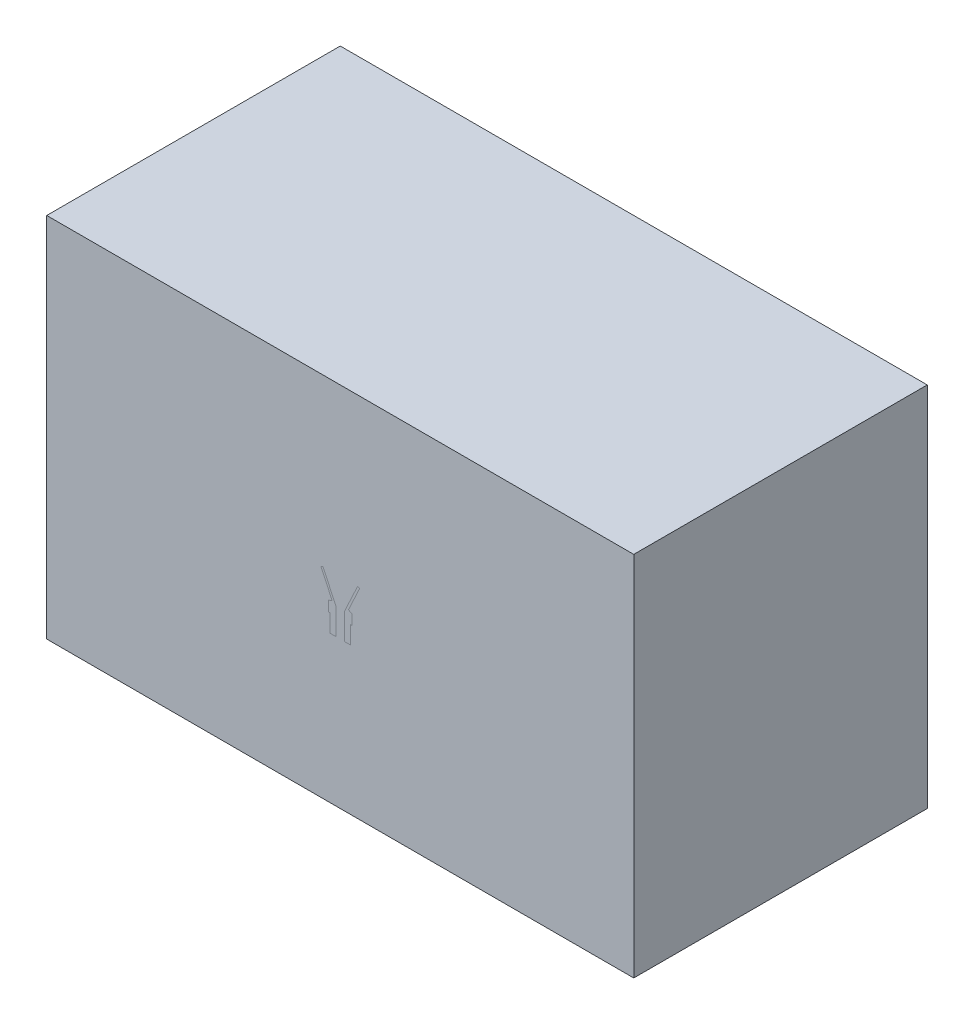
ISO-10303-21;
HEADER;
FILE_DESCRIPTION(('STEP AP214'),'2;1');
FILE_NAME('part.step','',(''),(''),'','','');
FILE_SCHEMA(('AUTOMOTIVE_DESIGN { 1 0 10303 214 1 1 1 1 }'));
ENDSEC;
DATA;
#1=APPLICATION_CONTEXT('core data for automotive mechanical design processes');
#2=APPLICATION_PROTOCOL_DEFINITION('international standard','automotive_design',2000,#1);
#3=PRODUCT_CONTEXT('',#1,'mechanical');
#4=PRODUCT('Part','Part','',(#3));
#5=PRODUCT_RELATED_PRODUCT_CATEGORY('part','',(#4));
#6=PRODUCT_DEFINITION_FORMATION('','',#4);
#7=PRODUCT_DEFINITION_CONTEXT('part definition',#1,'design');
#8=PRODUCT_DEFINITION('design','',#6,#7);
#9=PRODUCT_DEFINITION_SHAPE('','',#8);
#10=(LENGTH_UNIT() NAMED_UNIT(*) SI_UNIT(.MILLI.,.METRE.));
#11=(NAMED_UNIT(*) PLANE_ANGLE_UNIT() SI_UNIT($,.RADIAN.));
#12=(NAMED_UNIT(*) SI_UNIT($,.STERADIAN.) SOLID_ANGLE_UNIT());
#13=UNCERTAINTY_MEASURE_WITH_UNIT(LENGTH_MEASURE(1.E-05),#10,'distance_accuracy_value','');
#14=(GEOMETRIC_REPRESENTATION_CONTEXT(3) GLOBAL_UNCERTAINTY_ASSIGNED_CONTEXT((#13)) GLOBAL_UNIT_ASSIGNED_CONTEXT((#10,
#11,#12)) REPRESENTATION_CONTEXT('',''));
#15=CARTESIAN_POINT('',(0.,0.,0.));
#16=DIRECTION('',(0.,0.,1.));
#17=DIRECTION('',(1.,0.,0.));
#18=AXIS2_PLACEMENT_3D('',#15,#16,#17);
#19=CARTESIAN_POINT('',(0.,457.,0.));
#20=DIRECTION('',(0.,1.,0.));
#21=DIRECTION('',(0.,0.,1.));
#22=AXIS2_PLACEMENT_3D('',#19,#20,#21);
#23=CONICAL_SURFACE('',#22,75.,0.436330149975111);
#24=DIRECTION('',(0.422616301374695,0.906308701167749,0.));
#25=VECTOR('',#24,1.);
#26=CARTESIAN_POINT('',(0.,296.16107266455,0.));
#27=LINE('',#26,#25);
#28=CARTESIAN_POINT('',(300.423535153262,940.425061202877,0.));
#29=VERTEX_POINT('',#28);
#30=CARTESIAN_POINT('',(75.,457.,0.));
#31=VERTEX_POINT('',#30);
#32=EDGE_CURVE('E171',#29,#31,#27,.F.);
#33=ORIENTED_EDGE('',*,*,#32,.F.);
#34=CARTESIAN_POINT('',(0.,940.425061202877,0.));
#35=DIRECTION('',(0.,-1.,0.));
#36=DIRECTION('',(0.,0.,-1.));
#37=AXIS2_PLACEMENT_3D('',#34,#35,#36);
#38=CIRCLE('',#37,300.423535153262);
#39=CARTESIAN_POINT('',(-300.423535153262,940.425061202877,0.));
#40=VERTEX_POINT('',#39);
#41=EDGE_CURVE('E155',#40,#29,#38,.T.);
#42=ORIENTED_EDGE('',*,*,#41,.F.);
#43=DIRECTION('',(0.422616301374695,-0.906308701167749,0.));
#44=VECTOR('',#43,1.);
#45=CARTESIAN_POINT('',(0.,296.16107266455,0.));
#46=LINE('',#45,#44);
#47=CARTESIAN_POINT('',(-75.,457.,0.));
#48=VERTEX_POINT('',#47);
#49=EDGE_CURVE('E136',#48,#40,#46,.F.);
#50=ORIENTED_EDGE('',*,*,#49,.F.);
#51=CARTESIAN_POINT('',(0.,457.,0.));
#52=DIRECTION('',(0.,-1.,0.));
#53=DIRECTION('',(0.,0.,-1.));
#54=AXIS2_PLACEMENT_3D('',#51,#52,#53);
#55=CIRCLE('',#54,75.);
#56=EDGE_CURVE('E124',#48,#31,#55,.T.);
#57=ORIENTED_EDGE('',*,*,#56,.T.);
#58=EDGE_LOOP('',(#33,#42,#50,#57));
#59=FACE_BOUND('',#58,.T.);
#60=ADVANCED_FACE('F49',(#59),#23,.F.);
#61=CARTESIAN_POINT('',(0.,940.425061202877,0.));
#62=DIRECTION('',(0.,-1.,0.));
#63=DIRECTION('',(0.,0.,-1.));
#64=AXIS2_PLACEMENT_3D('',#61,#62,#63);
#65=CONICAL_SURFACE('',#64,300.423535153262,1.13446617681979);
#66=DIRECTION('',(-0.90630870116775,-0.422616301374694,0.));
#67=VECTOR('',#66,1.);
#68=CARTESIAN_POINT('',(0.,1080.51406521309,0.));
#69=LINE('',#68,#67);
#70=CARTESIAN_POINT('',(-334.953896667754,924.323380120502,0.));
#71=VERTEX_POINT('',#70);
#72=EDGE_CURVE('E140',#40,#71,#69,.T.);
#73=ORIENTED_EDGE('',*,*,#72,.F.);
#74=ORIENTED_EDGE('',*,*,#41,.T.);
#75=DIRECTION('',(-0.90630870116775,0.422616301374694,0.));
#76=VECTOR('',#75,1.);
#77=CARTESIAN_POINT('',(0.,1080.51406521309,0.));
#78=LINE('',#77,#76);
#79=CARTESIAN_POINT('',(334.953896667754,924.323380120502,0.));
#80=VERTEX_POINT('',#79);
#81=EDGE_CURVE('E173',#80,#29,#78,.T.);
#82=ORIENTED_EDGE('',*,*,#81,.F.);
#83=CARTESIAN_POINT('',(0.,924.323380120502,0.));
#84=DIRECTION('',(0.,-1.,0.));
#85=DIRECTION('',(0.,0.,-1.));
#86=AXIS2_PLACEMENT_3D('',#83,#84,#85);
#87=CIRCLE('',#86,334.953896667754);
#88=EDGE_CURVE('E152',#71,#80,#87,.T.);
#89=ORIENTED_EDGE('',*,*,#88,.F.);
#90=EDGE_LOOP('',(#73,#74,#82,#89));
#91=FACE_BOUND('',#90,.T.);
#92=ADVANCED_FACE('F199',(#91),#65,.T.);
#93=CARTESIAN_POINT('',(0.,924.323380120502,0.));
#94=DIRECTION('',(0.,1.,0.));
#95=DIRECTION('',(0.,0.,1.));
#96=AXIS2_PLACEMENT_3D('',#93,#94,#95);
#97=CONICAL_SURFACE('',#96,334.953896667754,0.436330149975111);
#98=DIRECTION('',(0.422616301374695,0.906308701167749,0.));
#99=VECTOR('',#98,1.);
#100=CARTESIAN_POINT('',(0.,206.008374162227,0.));
#101=LINE('',#100,#99);
#102=CARTESIAN_POINT('',(141.656158966261,509.792702943472,0.));
#103=VERTEX_POINT('',#102);
#104=EDGE_CURVE('E175',#103,#80,#101,.T.);
#105=ORIENTED_EDGE('',*,*,#104,.F.);
#106=CARTESIAN_POINT('',(0.,509.792702943472,0.));
#107=DIRECTION('',(0.,-1.,0.));
#108=DIRECTION('',(0.,0.,-1.));
#109=AXIS2_PLACEMENT_3D('',#106,#107,#108);
#110=CIRCLE('',#109,141.656158966261);
#111=CARTESIAN_POINT('',(-141.656158966261,509.792702943472,0.));
#112=VERTEX_POINT('',#111);
#113=EDGE_CURVE('E149',#112,#103,#110,.T.);
#114=ORIENTED_EDGE('',*,*,#113,.F.);
#115=DIRECTION('',(0.422616301374695,-0.906308701167749,0.));
#116=VECTOR('',#115,1.);
#117=CARTESIAN_POINT('',(0.,206.008374162227,0.));
#118=LINE('',#117,#116);
#119=EDGE_CURVE('E161',#71,#112,#118,.T.);
#120=ORIENTED_EDGE('',*,*,#119,.F.);
#121=ORIENTED_EDGE('',*,*,#88,.T.);
#122=EDGE_LOOP('',(#105,#114,#120,#121));
#123=FACE_BOUND('',#122,.T.);
#124=ADVANCED_FACE('F205',(#123),#97,.T.);
#125=CARTESIAN_POINT('',(0.,509.792702943472,0.));
#126=DIRECTION('',(0.,-1.,0.));
#127=DIRECTION('',(0.,0.,-1.));
#128=AXIS2_PLACEMENT_3D('',#125,#126,#127);
#129=CONICAL_SURFACE('',#128,141.656158966261,1.13446401379632);
#130=DIRECTION('',(-0.906307787036652,-0.422618261740694,0.));
#131=VECTOR('',#130,1.);
#132=CARTESIAN_POINT('',(0.,575.84805469426,0.));
#133=LINE('',#132,#131);
#134=CARTESIAN_POINT('',(-200.4,482.4,0.));
#135=VERTEX_POINT('',#134);
#136=EDGE_CURVE('E163',#112,#135,#133,.T.);
#137=ORIENTED_EDGE('',*,*,#136,.F.);
#138=ORIENTED_EDGE('',*,*,#113,.T.);
#139=DIRECTION('',(-0.906307787036652,0.422618261740694,0.));
#140=VECTOR('',#139,1.);
#141=CARTESIAN_POINT('',(0.,575.84805469426,0.));
#142=LINE('',#141,#140);
#143=CARTESIAN_POINT('',(200.4,482.4,0.));
#144=VERTEX_POINT('',#143);
#145=EDGE_CURVE('E177',#144,#103,#142,.T.);
#146=ORIENTED_EDGE('',*,*,#145,.F.);
#147=CARTESIAN_POINT('',(0.,482.4,0.));
#148=DIRECTION('',(0.,-1.,0.));
#149=DIRECTION('',(0.,0.,-1.));
#150=AXIS2_PLACEMENT_3D('',#147,#148,#149);
#151=CIRCLE('',#150,200.4);
#152=EDGE_CURVE('E146',#135,#144,#151,.T.);
#153=ORIENTED_EDGE('',*,*,#152,.F.);
#154=EDGE_LOOP('',(#137,#138,#146,#153));
#155=FACE_BOUND('',#154,.T.);
#156=ADVANCED_FACE('F213',(#155),#129,.T.);
#157=CARTESIAN_POINT('',(0.,0.,0.));
#158=DIRECTION('',(0.,-1.,0.));
#159=DIRECTION('',(0.,0.,-1.));
#160=AXIS2_PLACEMENT_3D('',#157,#158,#159);
#161=CYLINDRICAL_SURFACE('',#160,200.4);
#162=DIRECTION('',(0.,-1.,0.));
#163=VECTOR('',#162,1.);
#164=CARTESIAN_POINT('',(-200.4,0.,0.));
#165=LINE('',#164,#163);
#166=CARTESIAN_POINT('',(-200.4,307.,0.));
#167=VERTEX_POINT('',#166);
#168=EDGE_CURVE('E165',#135,#167,#165,.T.);
#169=ORIENTED_EDGE('',*,*,#168,.F.);
#170=ORIENTED_EDGE('',*,*,#152,.T.);
#171=DIRECTION('',(0.,-1.,0.));
#172=VECTOR('',#171,1.);
#173=CARTESIAN_POINT('',(200.4,0.,0.));
#174=LINE('',#173,#172);
#175=CARTESIAN_POINT('',(200.4,307.,0.));
#176=VERTEX_POINT('',#175);
#177=EDGE_CURVE('E131',#176,#144,#174,.F.);
#178=ORIENTED_EDGE('',*,*,#177,.F.);
#179=CARTESIAN_POINT('',(0.,307.,0.));
#180=DIRECTION('',(0.,-1.,0.));
#181=DIRECTION('',(0.,0.,-1.));
#182=AXIS2_PLACEMENT_3D('',#179,#180,#181);
#183=CIRCLE('',#182,200.4);
#184=EDGE_CURVE('E130',#167,#176,#183,.T.);
#185=ORIENTED_EDGE('',*,*,#184,.F.);
#186=EDGE_LOOP('',(#169,#170,#178,#185));
#187=FACE_BOUND('',#186,.T.);
#188=ADVANCED_FACE('F217',(#187),#161,.T.);
#189=CARTESIAN_POINT('',(-175.,307.,0.));
#190=DIRECTION('',(0.,1.,0.));
#191=DIRECTION('',(0.,0.,1.));
#192=AXIS2_PLACEMENT_3D('',#189,#190,#191);
#193=PLANE('',#192);
#194=DIRECTION('',(1.,0.,0.));
#195=VECTOR('',#194,1.);
#196=CARTESIAN_POINT('',(-175.,307.,0.));
#197=LINE('',#196,#195);
#198=CARTESIAN_POINT('',(-175.,307.,0.));
#199=VERTEX_POINT('',#198);
#200=EDGE_CURVE('E71',#167,#199,#197,.T.);
#201=ORIENTED_EDGE('',*,*,#200,.F.);
#202=ORIENTED_EDGE('',*,*,#184,.T.);
#203=CARTESIAN_POINT('',(175.,307.,0.));
#204=VERTEX_POINT('',#203);
#205=EDGE_CURVE('E118',#204,#176,#197,.T.);
#206=ORIENTED_EDGE('',*,*,#205,.F.);
#207=CARTESIAN_POINT('',(0.,307.,0.));
#208=DIRECTION('',(0.,1.,0.));
#209=DIRECTION('',(0.,0.,1.));
#210=AXIS2_PLACEMENT_3D('',#207,#208,#209);
#211=CIRCLE('',#210,175.);
#212=EDGE_CURVE('E128',#204,#199,#211,.T.);
#213=ORIENTED_EDGE('',*,*,#212,.T.);
#214=EDGE_LOOP('',(#201,#202,#206,#213));
#215=FACE_BOUND('',#214,.T.);
#216=ADVANCED_FACE('F51',(#215),#193,.F.);
#217=CARTESIAN_POINT('',(0.,457.,0.));
#218=DIRECTION('',(0.,-1.,0.));
#219=DIRECTION('',(0.,0.,-1.));
#220=AXIS2_PLACEMENT_3D('',#217,#218,#219);
#221=CYLINDRICAL_SURFACE('',#220,75.);
#222=ORIENTED_EDGE('',*,*,#56,.F.);
#223=DIRECTION('',(0.,-1.,0.));
#224=VECTOR('',#223,1.);
#225=CARTESIAN_POINT('',(-75.,457.,0.));
#226=LINE('',#225,#224);
#227=CARTESIAN_POINT('',(-75.,0.,0.));
#228=VERTEX_POINT('',#227);
#229=EDGE_CURVE('E167',#48,#228,#226,.T.);
#230=ORIENTED_EDGE('',*,*,#229,.T.);
#231=CARTESIAN_POINT('',(0.,0.,0.));
#232=DIRECTION('',(0.,1.,0.));
#233=DIRECTION('',(0.,0.,1.));
#234=AXIS2_PLACEMENT_3D('',#231,#232,#233);
#235=CIRCLE('',#234,75.);
#236=CARTESIAN_POINT('',(75.,0.,0.));
#237=VERTEX_POINT('',#236);
#238=EDGE_CURVE('E138',#237,#228,#235,.T.);
#239=ORIENTED_EDGE('',*,*,#238,.F.);
#240=DIRECTION('',(0.,-1.,0.));
#241=VECTOR('',#240,1.);
#242=CARTESIAN_POINT('',(75.,457.,0.));
#243=LINE('',#242,#241);
#244=EDGE_CURVE('E132',#237,#31,#243,.F.);
#245=ORIENTED_EDGE('',*,*,#244,.T.);
#246=EDGE_LOOP('',(#222,#230,#239,#245));
#247=FACE_BOUND('',#246,.T.);
#248=ADVANCED_FACE('F189',(#247),#221,.F.);
#249=CARTESIAN_POINT('',(0.,0.,0.));
#250=DIRECTION('',(0.,1.,0.));
#251=DIRECTION('',(0.,0.,1.));
#252=AXIS2_PLACEMENT_3D('',#249,#250,#251);
#253=PLANE('',#252);
#254=DIRECTION('',(1.,0.,0.));
#255=VECTOR('',#254,1.);
#256=CARTESIAN_POINT('',(0.,0.,0.));
#257=LINE('',#256,#255);
#258=CARTESIAN_POINT('',(-175.,0.,0.));
#259=VERTEX_POINT('',#258);
#260=EDGE_CURVE('E170',#259,#228,#257,.T.);
#261=ORIENTED_EDGE('',*,*,#260,.F.);
#262=CARTESIAN_POINT('',(0.,0.,0.));
#263=DIRECTION('',(0.,1.,0.));
#264=DIRECTION('',(0.,0.,1.));
#265=AXIS2_PLACEMENT_3D('',#262,#263,#264);
#266=CIRCLE('',#265,175.);
#267=CARTESIAN_POINT('',(175.,0.,0.));
#268=VERTEX_POINT('',#267);
#269=EDGE_CURVE('E135',#268,#259,#266,.T.);
#270=ORIENTED_EDGE('',*,*,#269,.F.);
#271=EDGE_CURVE('E64',#237,#268,#257,.T.);
#272=ORIENTED_EDGE('',*,*,#271,.F.);
#273=ORIENTED_EDGE('',*,*,#238,.T.);
#274=EDGE_LOOP('',(#261,#270,#272,#273));
#275=FACE_BOUND('',#274,.T.);
#276=ADVANCED_FACE('F190',(#275),#253,.F.);
#277=CARTESIAN_POINT('',(0.,457.,0.));
#278=DIRECTION('',(0.,-1.,0.));
#279=DIRECTION('',(0.,0.,-1.));
#280=AXIS2_PLACEMENT_3D('',#277,#278,#279);
#281=CYLINDRICAL_SURFACE('',#280,175.);
#282=DIRECTION('',(0.,-1.,0.));
#283=VECTOR('',#282,1.);
#284=CARTESIAN_POINT('',(-175.,457.,0.));
#285=LINE('',#284,#283);
#286=EDGE_CURVE('E12',#199,#259,#285,.T.);
#287=ORIENTED_EDGE('',*,*,#286,.F.);
#288=ORIENTED_EDGE('',*,*,#212,.F.);
#289=DIRECTION('',(0.,-1.,0.));
#290=VECTOR('',#289,1.);
#291=CARTESIAN_POINT('',(175.,457.,0.));
#292=LINE('',#291,#290);
#293=EDGE_CURVE('E57',#268,#204,#292,.F.);
#294=ORIENTED_EDGE('',*,*,#293,.F.);
#295=ORIENTED_EDGE('',*,*,#269,.T.);
#296=EDGE_LOOP('',(#287,#288,#294,#295));
#297=FACE_BOUND('',#296,.T.);
#298=ADVANCED_FACE('F134',(#297),#281,.T.);
#299=CARTESIAN_POINT('',(0.,0.,0.));
#300=DIRECTION('',(0.,0.,1.));
#301=DIRECTION('',(1.,0.,0.));
#302=AXIS2_PLACEMENT_3D('',#299,#300,#301);
#303=PLANE('',#302);
#304=ORIENTED_EDGE('',*,*,#32,.T.);
#305=ORIENTED_EDGE('',*,*,#244,.F.);
#306=ORIENTED_EDGE('',*,*,#271,.T.);
#307=ORIENTED_EDGE('',*,*,#293,.T.);
#308=ORIENTED_EDGE('',*,*,#205,.T.);
#309=ORIENTED_EDGE('',*,*,#177,.T.);
#310=ORIENTED_EDGE('',*,*,#145,.T.);
#311=ORIENTED_EDGE('',*,*,#104,.T.);
#312=ORIENTED_EDGE('',*,*,#81,.T.);
#313=EDGE_LOOP('',(#304,#305,#306,#307,#308,#309,#310,#311,#312));
#314=FACE_BOUND('',#313,.T.);
#315=ADVANCED_FACE('F117',(#314),#303,.T.);
#316=ORIENTED_EDGE('',*,*,#49,.T.);
#317=ORIENTED_EDGE('',*,*,#72,.T.);
#318=ORIENTED_EDGE('',*,*,#119,.T.);
#319=ORIENTED_EDGE('',*,*,#136,.T.);
#320=ORIENTED_EDGE('',*,*,#168,.T.);
#321=ORIENTED_EDGE('',*,*,#200,.T.);
#322=ORIENTED_EDGE('',*,*,#286,.T.);
#323=ORIENTED_EDGE('',*,*,#260,.T.);
#324=ORIENTED_EDGE('',*,*,#229,.F.);
#325=EDGE_LOOP('',(#316,#317,#318,#319,#320,#321,#322,#323,#324));
#326=FACE_BOUND('',#325,.T.);
#327=ADVANCED_FACE('F183',(#326),#303,.T.);
#328=CLOSED_SHELL('',(#60,#92,#124,#156,#188,#216,#248,#276,#298,#315,#327));
#329=MANIFOLD_SOLID_BREP('B2',#328);
#330=CARTESIAN_POINT('',(5080.,-2540.,5080.));
#331=DIRECTION('',(0.,1.,0.));
#332=DIRECTION('',(0.,0.,1.));
#333=AXIS2_PLACEMENT_3D('',#330,#331,#332);
#334=PLANE('',#333);
#335=DIRECTION('',(1.,0.,0.));
#336=VECTOR('',#335,1.);
#337=CARTESIAN_POINT('',(5080.,-2540.,0.));
#338=LINE('',#337,#336);
#339=CARTESIAN_POINT('',(-5080.,-2540.,0.));
#340=VERTEX_POINT('',#339);
#341=CARTESIAN_POINT('',(5080.,-2540.,0.));
#342=VERTEX_POINT('',#341);
#343=EDGE_CURVE('E481',#340,#342,#338,.T.);
#344=ORIENTED_EDGE('',*,*,#343,.F.);
#345=DIRECTION('',(0.,0.,-1.));
#346=VECTOR('',#345,1.);
#347=CARTESIAN_POINT('',(-5080.,-2540.,5080.));
#348=LINE('',#347,#346);
#349=CARTESIAN_POINT('',(-5080.,-2540.,-5080.));
#350=VERTEX_POINT('',#349);
#351=EDGE_CURVE('E466',#340,#350,#348,.T.);
#352=ORIENTED_EDGE('',*,*,#351,.T.);
#353=DIRECTION('',(-1.,0.,0.));
#354=VECTOR('',#353,1.);
#355=CARTESIAN_POINT('',(5080.,-2540.,-5080.));
#356=LINE('',#355,#354);
#357=CARTESIAN_POINT('',(5080.,-2540.,-5080.));
#358=VERTEX_POINT('',#357);
#359=EDGE_CURVE('E425',#358,#350,#356,.T.);
#360=ORIENTED_EDGE('',*,*,#359,.F.);
#361=DIRECTION('',(0.,0.,-1.));
#362=VECTOR('',#361,1.);
#363=CARTESIAN_POINT('',(5080.,-2540.,5080.));
#364=LINE('',#363,#362);
#365=EDGE_CURVE('E462',#342,#358,#364,.T.);
#366=ORIENTED_EDGE('',*,*,#365,.F.);
#367=EDGE_LOOP('',(#344,#352,#360,#366));
#368=FACE_BOUND('',#367,.T.);
#369=ADVANCED_FACE('F303',(#368),#334,.F.);
#370=CARTESIAN_POINT('',(5080.,3810.00000000001,5080.));
#371=DIRECTION('',(0.,-1.,0.));
#372=DIRECTION('',(0.,0.,-1.));
#373=AXIS2_PLACEMENT_3D('',#370,#371,#372);
#374=PLANE('',#373);
#375=DIRECTION('',(-1.,0.,0.));
#376=VECTOR('',#375,1.);
#377=CARTESIAN_POINT('',(5080.,3810.,0.));
#378=LINE('',#377,#376);
#379=CARTESIAN_POINT('',(5080.,3810.,0.));
#380=VERTEX_POINT('',#379);
#381=CARTESIAN_POINT('',(-5080.,3810.,1.77635683940025E-12));
#382=VERTEX_POINT('',#381);
#383=EDGE_CURVE('E319',#380,#382,#378,.T.);
#384=ORIENTED_EDGE('',*,*,#383,.F.);
#385=DIRECTION('',(0.,0.,1.));
#386=VECTOR('',#385,1.);
#387=CARTESIAN_POINT('',(5080.,3810.00000000001,5080.));
#388=LINE('',#387,#386);
#389=CARTESIAN_POINT('',(5080.,3810.,-5080.));
#390=VERTEX_POINT('',#389);
#391=EDGE_CURVE('E457',#390,#380,#388,.T.);
#392=ORIENTED_EDGE('',*,*,#391,.F.);
#393=DIRECTION('',(-1.,0.,0.));
#394=VECTOR('',#393,1.);
#395=CARTESIAN_POINT('',(5080.,3810.,-5080.));
#396=LINE('',#395,#394);
#397=CARTESIAN_POINT('',(-5080.,3810.,-5080.));
#398=VERTEX_POINT('',#397);
#399=EDGE_CURVE('E453',#390,#398,#396,.T.);
#400=ORIENTED_EDGE('',*,*,#399,.T.);
#401=DIRECTION('',(0.,0.,1.));
#402=VECTOR('',#401,1.);
#403=CARTESIAN_POINT('',(-5080.,3810.00000000001,5080.));
#404=LINE('',#403,#402);
#405=EDGE_CURVE('E458',#398,#382,#404,.T.);
#406=ORIENTED_EDGE('',*,*,#405,.T.);
#407=EDGE_LOOP('',(#384,#392,#400,#406));
#408=FACE_BOUND('',#407,.T.);
#409=ADVANCED_FACE('F570',(#408),#374,.F.);
#410=CARTESIAN_POINT('',(5080.,0.,0.));
#411=DIRECTION('',(1.,0.,0.));
#412=DIRECTION('',(0.,0.,-1.));
#413=AXIS2_PLACEMENT_3D('',#410,#411,#412);
#414=PLANE('',#413);
#415=ORIENTED_EDGE('',*,*,#391,.T.);
#416=DIRECTION('',(0.,-1.,0.));
#417=VECTOR('',#416,1.);
#418=CARTESIAN_POINT('',(5080.,0.,0.));
#419=LINE('',#418,#417);
#420=EDGE_CURVE('E469',#380,#342,#419,.T.);
#421=ORIENTED_EDGE('',*,*,#420,.T.);
#422=ORIENTED_EDGE('',*,*,#365,.T.);
#423=DIRECTION('',(0.,1.,0.));
#424=VECTOR('',#423,1.);
#425=CARTESIAN_POINT('',(5080.,3810.,-5080.));
#426=LINE('',#425,#424);
#427=EDGE_CURVE('E473',#358,#390,#426,.T.);
#428=ORIENTED_EDGE('',*,*,#427,.T.);
#429=EDGE_LOOP('',(#415,#421,#422,#428));
#430=FACE_BOUND('',#429,.T.);
#431=ADVANCED_FACE('F576',(#430),#414,.T.);
#432=CARTESIAN_POINT('',(-5080.,0.,0.));
#433=DIRECTION('',(1.,0.,0.));
#434=DIRECTION('',(0.,0.,-1.));
#435=AXIS2_PLACEMENT_3D('',#432,#433,#434);
#436=PLANE('',#435);
#437=DIRECTION('',(0.,-1.,0.));
#438=VECTOR('',#437,1.);
#439=CARTESIAN_POINT('',(-5080.,0.,0.));
#440=LINE('',#439,#438);
#441=EDGE_CURVE('E486',#382,#340,#440,.T.);
#442=ORIENTED_EDGE('',*,*,#441,.F.);
#443=ORIENTED_EDGE('',*,*,#405,.F.);
#444=DIRECTION('',(0.,1.,0.));
#445=VECTOR('',#444,1.);
#446=CARTESIAN_POINT('',(-5080.,3810.,-5080.));
#447=LINE('',#446,#445);
#448=EDGE_CURVE('E463',#350,#398,#447,.T.);
#449=ORIENTED_EDGE('',*,*,#448,.F.);
#450=ORIENTED_EDGE('',*,*,#351,.F.);
#451=EDGE_LOOP('',(#442,#443,#449,#450));
#452=FACE_BOUND('',#451,.T.);
#453=ADVANCED_FACE('F583',(#452),#436,.F.);
#454=CARTESIAN_POINT('',(5080.,3810.,-5080.));
#455=DIRECTION('',(0.,0.,1.));
#456=DIRECTION('',(0.,-1.,0.));
#457=AXIS2_PLACEMENT_3D('',#454,#455,#456);
#458=PLANE('',#457);
#459=ORIENTED_EDGE('',*,*,#448,.T.);
#460=ORIENTED_EDGE('',*,*,#399,.F.);
#461=ORIENTED_EDGE('',*,*,#427,.F.);
#462=ORIENTED_EDGE('',*,*,#359,.T.);
#463=EDGE_LOOP('',(#459,#460,#461,#462));
#464=FACE_BOUND('',#463,.T.);
#465=ADVANCED_FACE('F581',(#464),#458,.F.);
#466=CARTESIAN_POINT('',(0.,0.,0.));
#467=DIRECTION('',(0.,0.,1.));
#468=DIRECTION('',(1.,0.,0.));
#469=AXIS2_PLACEMENT_3D('',#466,#467,#468);
#470=PLANE('',#469);
#471=ORIENTED_EDGE('',*,*,#383,.T.);
#472=ORIENTED_EDGE('',*,*,#441,.T.);
#473=ORIENTED_EDGE('',*,*,#343,.T.);
#474=ORIENTED_EDGE('',*,*,#420,.F.);
#475=EDGE_LOOP('',(#471,#472,#473,#474));
#476=FACE_BOUND('',#475,.T.);
#477=DIRECTION('',(0.,-1.,0.));
#478=VECTOR('',#477,1.);
#479=CARTESIAN_POINT('',(-75.,457.,0.));
#480=LINE('',#479,#478);
#481=CARTESIAN_POINT('',(-75.,457.,0.));
#482=VERTEX_POINT('',#481);
#483=CARTESIAN_POINT('',(-75.,0.,0.));
#484=VERTEX_POINT('',#483);
#485=EDGE_CURVE('E510',#482,#484,#480,.T.);
#486=ORIENTED_EDGE('',*,*,#485,.T.);
#487=DIRECTION('',(1.,0.,0.));
#488=VECTOR('',#487,1.);
#489=CARTESIAN_POINT('',(0.,0.,0.));
#490=LINE('',#489,#488);
#491=CARTESIAN_POINT('',(-175.,0.,0.));
#492=VERTEX_POINT('',#491);
#493=EDGE_CURVE('E417',#492,#484,#490,.T.);
#494=ORIENTED_EDGE('',*,*,#493,.F.);
#495=DIRECTION('',(0.,-1.,0.));
#496=VECTOR('',#495,1.);
#497=CARTESIAN_POINT('',(-175.,457.,0.));
#498=LINE('',#497,#496);
#499=CARTESIAN_POINT('',(-175.,307.,0.));
#500=VERTEX_POINT('',#499);
#501=EDGE_CURVE('E47',#500,#492,#498,.T.);
#502=ORIENTED_EDGE('',*,*,#501,.F.);
#503=DIRECTION('',(1.,0.,0.));
#504=VECTOR('',#503,1.);
#505=CARTESIAN_POINT('',(-175.,307.,0.));
#506=LINE('',#505,#504);
#507=CARTESIAN_POINT('',(-200.4,307.,0.));
#508=VERTEX_POINT('',#507);
#509=EDGE_CURVE('E509',#508,#500,#506,.T.);
#510=ORIENTED_EDGE('',*,*,#509,.F.);
#511=DIRECTION('',(0.,-1.,0.));
#512=VECTOR('',#511,1.);
#513=CARTESIAN_POINT('',(-200.4,0.,0.));
#514=LINE('',#513,#512);
#515=CARTESIAN_POINT('',(-200.4,482.4,0.));
#516=VERTEX_POINT('',#515);
#517=EDGE_CURVE('E505',#516,#508,#514,.T.);
#518=ORIENTED_EDGE('',*,*,#517,.F.);
#519=DIRECTION('',(-0.906307787036652,-0.422618261740694,0.));
#520=VECTOR('',#519,1.);
#521=CARTESIAN_POINT('',(0.,575.84805469426,0.));
#522=LINE('',#521,#520);
#523=CARTESIAN_POINT('',(-141.656158966261,509.792702943472,0.));
#524=VERTEX_POINT('',#523);
#525=EDGE_CURVE('E501',#524,#516,#522,.T.);
#526=ORIENTED_EDGE('',*,*,#525,.F.);
#527=DIRECTION('',(0.422616301374695,-0.906308701167749,0.));
#528=VECTOR('',#527,1.);
#529=CARTESIAN_POINT('',(0.,206.008374162227,0.));
#530=LINE('',#529,#528);
#531=CARTESIAN_POINT('',(-334.953896667754,924.323380120502,0.));
#532=VERTEX_POINT('',#531);
#533=EDGE_CURVE('E497',#532,#524,#530,.T.);
#534=ORIENTED_EDGE('',*,*,#533,.F.);
#535=DIRECTION('',(-0.90630870116775,-0.422616301374694,0.));
#536=VECTOR('',#535,1.);
#537=CARTESIAN_POINT('',(0.,1080.51406521309,0.));
#538=LINE('',#537,#536);
#539=CARTESIAN_POINT('',(-300.423535153262,940.425061202877,0.));
#540=VERTEX_POINT('',#539);
#541=EDGE_CURVE('E493',#540,#532,#538,.T.);
#542=ORIENTED_EDGE('',*,*,#541,.F.);
#543=DIRECTION('',(0.422616301374695,-0.906308701167749,0.));
#544=VECTOR('',#543,1.);
#545=CARTESIAN_POINT('',(0.,296.16107266455,0.));
#546=LINE('',#545,#544);
#547=EDGE_CURVE('E489',#482,#540,#546,.F.);
#548=ORIENTED_EDGE('',*,*,#547,.F.);
#549=EDGE_LOOP('',(#486,#494,#502,#510,#518,#526,#534,#542,#548));
#550=FACE_BOUND('',#549,.T.);
#551=DIRECTION('',(-0.90630870116775,0.422616301374694,0.));
#552=VECTOR('',#551,1.);
#553=CARTESIAN_POINT('',(0.,1080.51406521309,0.));
#554=LINE('',#553,#552);
#555=CARTESIAN_POINT('',(334.953896667754,924.323380120502,0.));
#556=VERTEX_POINT('',#555);
#557=CARTESIAN_POINT('',(300.423535153262,940.425061202877,0.));
#558=VERTEX_POINT('',#557);
#559=EDGE_CURVE('E517',#556,#558,#554,.T.);
#560=ORIENTED_EDGE('',*,*,#559,.F.);
#561=DIRECTION('',(0.422616301374695,0.906308701167749,0.));
#562=VECTOR('',#561,1.);
#563=CARTESIAN_POINT('',(0.,206.008374162227,0.));
#564=LINE('',#563,#562);
#565=CARTESIAN_POINT('',(141.656158966261,509.792702943472,0.));
#566=VERTEX_POINT('',#565);
#567=EDGE_CURVE('E521',#566,#556,#564,.T.);
#568=ORIENTED_EDGE('',*,*,#567,.F.);
#569=DIRECTION('',(-0.906307787036652,0.422618261740694,0.));
#570=VECTOR('',#569,1.);
#571=CARTESIAN_POINT('',(0.,575.84805469426,0.));
#572=LINE('',#571,#570);
#573=CARTESIAN_POINT('',(200.4,482.4,0.));
#574=VERTEX_POINT('',#573);
#575=EDGE_CURVE('E525',#574,#566,#572,.T.);
#576=ORIENTED_EDGE('',*,*,#575,.F.);
#577=DIRECTION('',(0.,-1.,0.));
#578=VECTOR('',#577,1.);
#579=CARTESIAN_POINT('',(200.4,0.,0.));
#580=LINE('',#579,#578);
#581=CARTESIAN_POINT('',(200.4,307.,0.));
#582=VERTEX_POINT('',#581);
#583=EDGE_CURVE('E529',#582,#574,#580,.F.);
#584=ORIENTED_EDGE('',*,*,#583,.F.);
#585=CARTESIAN_POINT('',(175.,307.,0.));
#586=VERTEX_POINT('',#585);
#587=EDGE_CURVE('E327',#586,#582,#506,.T.);
#588=ORIENTED_EDGE('',*,*,#587,.F.);
#589=DIRECTION('',(0.,-1.,0.));
#590=VECTOR('',#589,1.);
#591=CARTESIAN_POINT('',(175.,457.,0.));
#592=LINE('',#591,#590);
#593=CARTESIAN_POINT('',(175.,0.,0.));
#594=VERTEX_POINT('',#593);
#595=EDGE_CURVE('E312',#594,#586,#592,.F.);
#596=ORIENTED_EDGE('',*,*,#595,.F.);
#597=CARTESIAN_POINT('',(75.,0.,0.));
#598=VERTEX_POINT('',#597);
#599=EDGE_CURVE('E398',#598,#594,#490,.T.);
#600=ORIENTED_EDGE('',*,*,#599,.F.);
#601=DIRECTION('',(0.,-1.,0.));
#602=VECTOR('',#601,1.);
#603=CARTESIAN_POINT('',(75.,457.,0.));
#604=LINE('',#603,#602);
#605=CARTESIAN_POINT('',(75.,457.,0.));
#606=VERTEX_POINT('',#605);
#607=EDGE_CURVE('E415',#598,#606,#604,.F.);
#608=ORIENTED_EDGE('',*,*,#607,.T.);
#609=DIRECTION('',(0.422616301374695,0.906308701167749,0.));
#610=VECTOR('',#609,1.);
#611=CARTESIAN_POINT('',(0.,296.16107266455,0.));
#612=LINE('',#611,#610);
#613=EDGE_CURVE('E513',#558,#606,#612,.F.);
#614=ORIENTED_EDGE('',*,*,#613,.F.);
#615=EDGE_LOOP('',(#560,#568,#576,#584,#588,#596,#600,#608,#614));
#616=FACE_BOUND('',#615,.T.);
#617=ADVANCED_FACE('F397',(#476,#550,#616),#470,.T.);
#618=CARTESIAN_POINT('',(0.,457.,0.));
#619=DIRECTION('',(0.,1.,0.));
#620=DIRECTION('',(0.,0.,1.));
#621=AXIS2_PLACEMENT_3D('',#618,#619,#620);
#622=CONICAL_SURFACE('',#621,75.,0.436330149975111);
#623=CARTESIAN_POINT('',(0.,940.425061202877,0.));
#624=DIRECTION('',(0.,-1.,0.));
#625=DIRECTION('',(0.,0.,-1.));
#626=AXIS2_PLACEMENT_3D('',#623,#624,#625);
#627=CIRCLE('',#626,300.423535153262);
#628=EDGE_CURVE('E443',#540,#558,#627,.T.);
#629=ORIENTED_EDGE('',*,*,#628,.T.);
#630=ORIENTED_EDGE('',*,*,#613,.T.);
#631=CARTESIAN_POINT('',(0.,457.,0.));
#632=DIRECTION('',(0.,-1.,0.));
#633=DIRECTION('',(0.,0.,-1.));
#634=AXIS2_PLACEMENT_3D('',#631,#632,#633);
#635=CIRCLE('',#634,75.);
#636=EDGE_CURVE('E405',#482,#606,#635,.T.);
#637=ORIENTED_EDGE('',*,*,#636,.F.);
#638=ORIENTED_EDGE('',*,*,#547,.T.);
#639=EDGE_LOOP('',(#629,#630,#637,#638));
#640=FACE_BOUND('',#639,.T.);
#641=ADVANCED_FACE('F539',(#640),#622,.T.);
#642=CARTESIAN_POINT('',(0.,940.425061202877,0.));
#643=DIRECTION('',(0.,-1.,0.));
#644=DIRECTION('',(0.,0.,-1.));
#645=AXIS2_PLACEMENT_3D('',#642,#643,#644);
#646=CONICAL_SURFACE('',#645,300.423535153262,1.13446617681979);
#647=ORIENTED_EDGE('',*,*,#628,.F.);
#648=ORIENTED_EDGE('',*,*,#541,.T.);
#649=CARTESIAN_POINT('',(0.,924.323380120502,0.));
#650=DIRECTION('',(0.,-1.,0.));
#651=DIRECTION('',(0.,0.,-1.));
#652=AXIS2_PLACEMENT_3D('',#649,#650,#651);
#653=CIRCLE('',#652,334.953896667754);
#654=EDGE_CURVE('E439',#532,#556,#653,.T.);
#655=ORIENTED_EDGE('',*,*,#654,.T.);
#656=ORIENTED_EDGE('',*,*,#559,.T.);
#657=EDGE_LOOP('',(#647,#648,#655,#656));
#658=FACE_BOUND('',#657,.T.);
#659=ADVANCED_FACE('F560',(#658),#646,.F.);
#660=CARTESIAN_POINT('',(0.,924.323380120502,0.));
#661=DIRECTION('',(0.,1.,0.));
#662=DIRECTION('',(0.,0.,1.));
#663=AXIS2_PLACEMENT_3D('',#660,#661,#662);
#664=CONICAL_SURFACE('',#663,334.953896667754,0.436330149975111);
#665=CARTESIAN_POINT('',(0.,509.792702943472,0.));
#666=DIRECTION('',(0.,-1.,0.));
#667=DIRECTION('',(0.,0.,-1.));
#668=AXIS2_PLACEMENT_3D('',#665,#666,#667);
#669=CIRCLE('',#668,141.656158966261);
#670=EDGE_CURVE('E435',#524,#566,#669,.T.);
#671=ORIENTED_EDGE('',*,*,#670,.T.);
#672=ORIENTED_EDGE('',*,*,#567,.T.);
#673=ORIENTED_EDGE('',*,*,#654,.F.);
#674=ORIENTED_EDGE('',*,*,#533,.T.);
#675=EDGE_LOOP('',(#671,#672,#673,#674));
#676=FACE_BOUND('',#675,.T.);
#677=ADVANCED_FACE('F558',(#676),#664,.F.);
#678=CARTESIAN_POINT('',(0.,509.792702943472,0.));
#679=DIRECTION('',(0.,-1.,0.));
#680=DIRECTION('',(0.,0.,-1.));
#681=AXIS2_PLACEMENT_3D('',#678,#679,#680);
#682=CONICAL_SURFACE('',#681,141.656158966261,1.13446401379632);
#683=ORIENTED_EDGE('',*,*,#670,.F.);
#684=ORIENTED_EDGE('',*,*,#525,.T.);
#685=CARTESIAN_POINT('',(0.,482.4,0.));
#686=DIRECTION('',(0.,-1.,0.));
#687=DIRECTION('',(0.,0.,-1.));
#688=AXIS2_PLACEMENT_3D('',#685,#686,#687);
#689=CIRCLE('',#688,200.4);
#690=EDGE_CURVE('E431',#516,#574,#689,.T.);
#691=ORIENTED_EDGE('',*,*,#690,.T.);
#692=ORIENTED_EDGE('',*,*,#575,.T.);
#693=EDGE_LOOP('',(#683,#684,#691,#692));
#694=FACE_BOUND('',#693,.T.);
#695=ADVANCED_FACE('F555',(#694),#682,.F.);
#696=CARTESIAN_POINT('',(0.,0.,0.));
#697=DIRECTION('',(0.,-1.,0.));
#698=DIRECTION('',(0.,0.,-1.));
#699=AXIS2_PLACEMENT_3D('',#696,#697,#698);
#700=CYLINDRICAL_SURFACE('',#699,200.4);
#701=ORIENTED_EDGE('',*,*,#690,.F.);
#702=ORIENTED_EDGE('',*,*,#517,.T.);
#703=CARTESIAN_POINT('',(0.,307.,0.));
#704=DIRECTION('',(0.,-1.,0.));
#705=DIRECTION('',(0.,0.,-1.));
#706=AXIS2_PLACEMENT_3D('',#703,#704,#705);
#707=CIRCLE('',#706,200.4);
#708=EDGE_CURVE('E423',#508,#582,#707,.T.);
#709=ORIENTED_EDGE('',*,*,#708,.T.);
#710=ORIENTED_EDGE('',*,*,#583,.T.);
#711=EDGE_LOOP('',(#701,#702,#709,#710));
#712=FACE_BOUND('',#711,.T.);
#713=ADVANCED_FACE('F552',(#712),#700,.F.);
#714=CARTESIAN_POINT('',(-175.,307.,0.));
#715=DIRECTION('',(0.,1.,0.));
#716=DIRECTION('',(0.,0.,1.));
#717=AXIS2_PLACEMENT_3D('',#714,#715,#716);
#718=PLANE('',#717);
#719=ORIENTED_EDGE('',*,*,#708,.F.);
#720=ORIENTED_EDGE('',*,*,#509,.T.);
#721=CARTESIAN_POINT('',(0.,307.,0.));
#722=DIRECTION('',(0.,1.,0.));
#723=DIRECTION('',(0.,0.,1.));
#724=AXIS2_PLACEMENT_3D('',#721,#722,#723);
#725=CIRCLE('',#724,175.);
#726=EDGE_CURVE('E419',#586,#500,#725,.T.);
#727=ORIENTED_EDGE('',*,*,#726,.F.);
#728=ORIENTED_EDGE('',*,*,#587,.T.);
#729=EDGE_LOOP('',(#719,#720,#727,#728));
#730=FACE_BOUND('',#729,.T.);
#731=ADVANCED_FACE('F549',(#730),#718,.T.);
#732=CARTESIAN_POINT('',(0.,457.,0.));
#733=DIRECTION('',(0.,-1.,0.));
#734=DIRECTION('',(0.,0.,-1.));
#735=AXIS2_PLACEMENT_3D('',#732,#733,#734);
#736=CYLINDRICAL_SURFACE('',#735,75.);
#737=ORIENTED_EDGE('',*,*,#485,.F.);
#738=ORIENTED_EDGE('',*,*,#636,.T.);
#739=ORIENTED_EDGE('',*,*,#607,.F.);
#740=CARTESIAN_POINT('',(0.,0.,0.));
#741=DIRECTION('',(0.,1.,0.));
#742=DIRECTION('',(0.,0.,1.));
#743=AXIS2_PLACEMENT_3D('',#740,#741,#742);
#744=CIRCLE('',#743,75.);
#745=EDGE_CURVE('E413',#598,#484,#744,.T.);
#746=ORIENTED_EDGE('',*,*,#745,.T.);
#747=EDGE_LOOP('',(#737,#738,#739,#746));
#748=FACE_BOUND('',#747,.T.);
#749=ADVANCED_FACE('F542',(#748),#736,.T.);
#750=CARTESIAN_POINT('',(0.,0.,0.));
#751=DIRECTION('',(0.,1.,0.));
#752=DIRECTION('',(0.,0.,1.));
#753=AXIS2_PLACEMENT_3D('',#750,#751,#752);
#754=PLANE('',#753);
#755=CARTESIAN_POINT('',(0.,0.,0.));
#756=DIRECTION('',(0.,1.,0.));
#757=DIRECTION('',(0.,0.,1.));
#758=AXIS2_PLACEMENT_3D('',#755,#756,#757);
#759=CIRCLE('',#758,175.);
#760=EDGE_CURVE('E411',#594,#492,#759,.T.);
#761=ORIENTED_EDGE('',*,*,#760,.T.);
#762=ORIENTED_EDGE('',*,*,#493,.T.);
#763=ORIENTED_EDGE('',*,*,#745,.F.);
#764=ORIENTED_EDGE('',*,*,#599,.T.);
#765=EDGE_LOOP('',(#761,#762,#763,#764));
#766=FACE_BOUND('',#765,.T.);
#767=ADVANCED_FACE('F409',(#766),#754,.T.);
#768=CARTESIAN_POINT('',(0.,457.,0.));
#769=DIRECTION('',(0.,-1.,0.));
#770=DIRECTION('',(0.,0.,-1.));
#771=AXIS2_PLACEMENT_3D('',#768,#769,#770);
#772=CYLINDRICAL_SURFACE('',#771,175.);
#773=ORIENTED_EDGE('',*,*,#726,.T.);
#774=ORIENTED_EDGE('',*,*,#501,.T.);
#775=ORIENTED_EDGE('',*,*,#760,.F.);
#776=ORIENTED_EDGE('',*,*,#595,.T.);
#777=EDGE_LOOP('',(#773,#774,#775,#776));
#778=FACE_BOUND('',#777,.T.);
#779=ADVANCED_FACE('F305',(#778),#772,.F.);
#780=CLOSED_SHELL('',(#369,#409,#431,#453,#465,#617,#641,#659,#677,#695,#713,#731,#749,#767,#779));
#781=MANIFOLD_SOLID_BREP('B6',#780);
#782=ADVANCED_BREP_SHAPE_REPRESENTATION('',(#18,#329,#781),#14);
#783=SHAPE_DEFINITION_REPRESENTATION(#9,#782);
ENDSEC;
END-ISO-10303-21;
